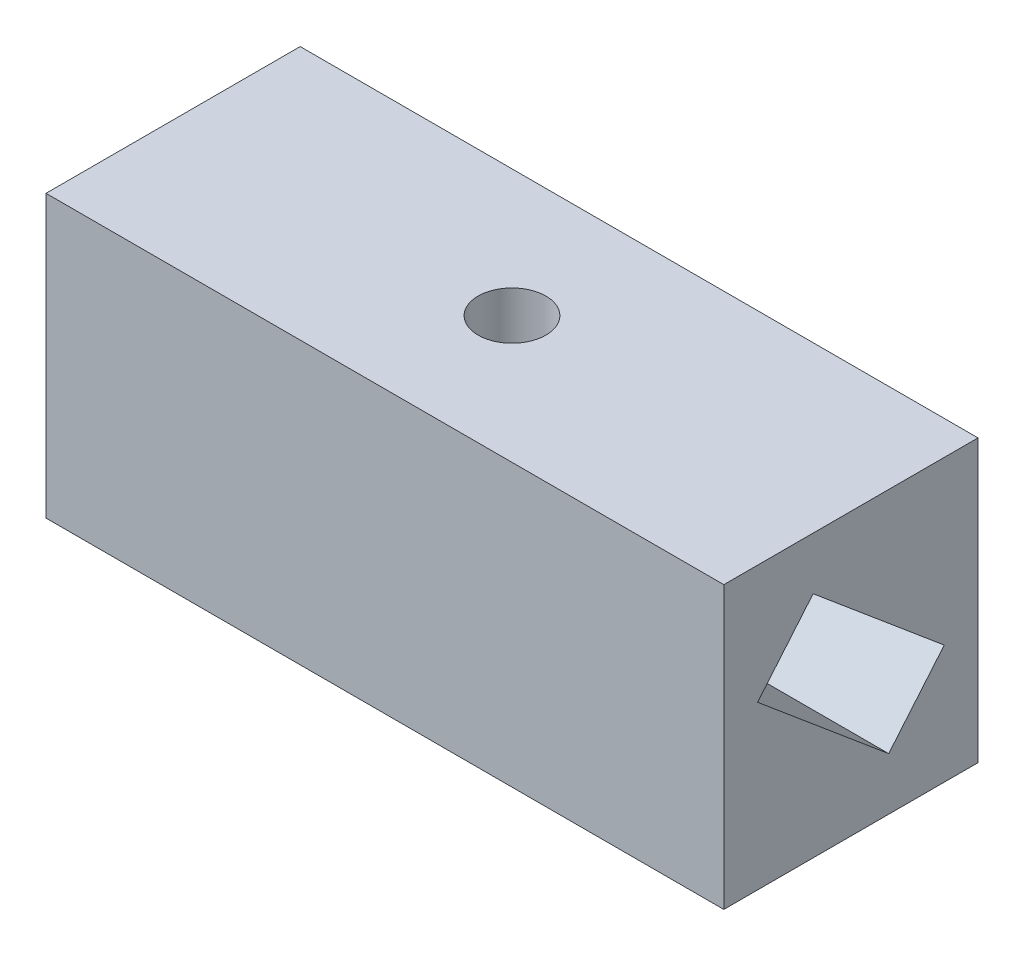
ISO-10303-21;
HEADER;
FILE_DESCRIPTION(('STEP AP214'),'2;1');
FILE_NAME('part.step','',(''),(''),'','','');
FILE_SCHEMA(('AUTOMOTIVE_DESIGN { 1 0 10303 214 1 1 1 1 }'));
ENDSEC;
DATA;
#1=APPLICATION_CONTEXT('core data for automotive mechanical design processes');
#2=APPLICATION_PROTOCOL_DEFINITION('international standard','automotive_design',2000,#1);
#3=PRODUCT_CONTEXT('',#1,'mechanical');
#4=PRODUCT('Part','Part','',(#3));
#5=PRODUCT_RELATED_PRODUCT_CATEGORY('part','',(#4));
#6=PRODUCT_DEFINITION_FORMATION('','',#4);
#7=PRODUCT_DEFINITION_CONTEXT('part definition',#1,'design');
#8=PRODUCT_DEFINITION('design','',#6,#7);
#9=PRODUCT_DEFINITION_SHAPE('','',#8);
#10=(LENGTH_UNIT() NAMED_UNIT(*) SI_UNIT(.MILLI.,.METRE.));
#11=(NAMED_UNIT(*) PLANE_ANGLE_UNIT() SI_UNIT($,.RADIAN.));
#12=(NAMED_UNIT(*) SI_UNIT($,.STERADIAN.) SOLID_ANGLE_UNIT());
#13=UNCERTAINTY_MEASURE_WITH_UNIT(LENGTH_MEASURE(1.E-05),#10,'distance_accuracy_value','');
#14=(GEOMETRIC_REPRESENTATION_CONTEXT(3) GLOBAL_UNCERTAINTY_ASSIGNED_CONTEXT((#13)) GLOBAL_UNIT_ASSIGNED_CONTEXT((#10,
#11,#12)) REPRESENTATION_CONTEXT('',''));
#15=CARTESIAN_POINT('',(0.,0.,0.));
#16=DIRECTION('',(0.,0.,1.));
#17=DIRECTION('',(1.,0.,0.));
#18=AXIS2_PLACEMENT_3D('',#15,#16,#17);
#19=CARTESIAN_POINT('',(40.,33.2,15.));
#20=DIRECTION('',(-1.,0.,0.));
#21=DIRECTION('',(0.,0.,1.));
#22=AXIS2_PLACEMENT_3D('',#19,#20,#21);
#23=PLANE('',#22);
#24=DIRECTION('',(0.,0.766044443118982,-0.642787609686534));
#25=VECTOR('',#24,1.);
#26=CARTESIAN_POINT('',(40.,14.0146718020728,-11.015265684903));
#27=LINE('',#26,#25);
#28=CARTESIAN_POINT('',(40.,6.20101848225919,-4.45883206610039));
#29=VERTEX_POINT('',#28);
#30=CARTESIAN_POINT('',(40.,14.0146718020728,-11.015265684903));
#31=VERTEX_POINT('',#30);
#32=EDGE_CURVE('E151',#29,#31,#27,.T.);
#33=ORIENTED_EDGE('',*,*,#32,.F.);
#34=DIRECTION('',(0.,-0.642787609686535,-0.766044443118982));
#35=VECTOR('',#34,1.);
#36=CARTESIAN_POINT('',(40.,6.20101848225919,-4.45883206610039));
#37=LINE('',#36,#35);
#38=CARTESIAN_POINT('',(40.,19.1853281979272,11.015265684903));
#39=VERTEX_POINT('',#38);
#40=EDGE_CURVE('E48',#39,#29,#37,.T.);
#41=ORIENTED_EDGE('',*,*,#40,.F.);
#42=DIRECTION('',(0.,-0.766044443118982,0.642787609686534));
#43=VECTOR('',#42,1.);
#44=CARTESIAN_POINT('',(40.,26.9989815177408,4.45883206610039));
#45=LINE('',#44,#43);
#46=CARTESIAN_POINT('',(40.,26.9989815177408,4.45883206610039));
#47=VERTEX_POINT('',#46);
#48=EDGE_CURVE('E142',#47,#39,#45,.T.);
#49=ORIENTED_EDGE('',*,*,#48,.F.);
#50=DIRECTION('',(0.,0.642787609686535,0.766044443118982));
#51=VECTOR('',#50,1.);
#52=CARTESIAN_POINT('',(40.,14.0146718020728,-11.015265684903));
#53=LINE('',#52,#51);
#54=EDGE_CURVE('E145',#31,#47,#53,.T.);
#55=ORIENTED_EDGE('',*,*,#54,.F.);
#56=EDGE_LOOP('',(#33,#41,#49,#55));
#57=FACE_BOUND('',#56,.T.);
#58=DIRECTION('',(0.,0.,-1.));
#59=VECTOR('',#58,1.);
#60=CARTESIAN_POINT('',(40.,0.,15.));
#61=LINE('',#60,#59);
#62=CARTESIAN_POINT('',(40.,0.,15.));
#63=VERTEX_POINT('',#62);
#64=CARTESIAN_POINT('',(40.,0.,-15.));
#65=VERTEX_POINT('',#64);
#66=EDGE_CURVE('E194',#63,#65,#61,.T.);
#67=ORIENTED_EDGE('',*,*,#66,.T.);
#68=DIRECTION('',(0.,-1.,0.));
#69=VECTOR('',#68,1.);
#70=CARTESIAN_POINT('',(40.,33.2,-15.));
#71=LINE('',#70,#69);
#72=CARTESIAN_POINT('',(40.,33.2,-15.));
#73=VERTEX_POINT('',#72);
#74=EDGE_CURVE('E11',#73,#65,#71,.T.);
#75=ORIENTED_EDGE('',*,*,#74,.F.);
#76=DIRECTION('',(0.,0.,-1.));
#77=VECTOR('',#76,1.);
#78=CARTESIAN_POINT('',(40.,33.2,15.));
#79=LINE('',#78,#77);
#80=CARTESIAN_POINT('',(40.,33.2,15.));
#81=VERTEX_POINT('',#80);
#82=EDGE_CURVE('E197',#81,#73,#79,.T.);
#83=ORIENTED_EDGE('',*,*,#82,.F.);
#84=DIRECTION('',(0.,-1.,0.));
#85=VECTOR('',#84,1.);
#86=CARTESIAN_POINT('',(40.,33.2,15.));
#87=LINE('',#86,#85);
#88=EDGE_CURVE('E207',#81,#63,#87,.T.);
#89=ORIENTED_EDGE('',*,*,#88,.T.);
#90=EDGE_LOOP('',(#67,#75,#83,#89));
#91=FACE_BOUND('',#90,.T.);
#92=ADVANCED_FACE('F34',(#57,#91),#23,.F.);
#93=CARTESIAN_POINT('',(-40.,33.2,-15.));
#94=DIRECTION('',(0.,0.,1.));
#95=DIRECTION('',(1.,0.,0.));
#96=AXIS2_PLACEMENT_3D('',#93,#94,#95);
#97=PLANE('',#96);
#98=DIRECTION('',(-1.,0.,0.));
#99=VECTOR('',#98,1.);
#100=CARTESIAN_POINT('',(-40.,0.,-15.));
#101=LINE('',#100,#99);
#102=CARTESIAN_POINT('',(-40.,0.,-15.));
#103=VERTEX_POINT('',#102);
#104=EDGE_CURVE('E210',#65,#103,#101,.T.);
#105=ORIENTED_EDGE('',*,*,#104,.T.);
#106=DIRECTION('',(0.,-1.,0.));
#107=VECTOR('',#106,1.);
#108=CARTESIAN_POINT('',(-40.,33.2,-15.));
#109=LINE('',#108,#107);
#110=CARTESIAN_POINT('',(-40.,33.2,-15.));
#111=VERTEX_POINT('',#110);
#112=EDGE_CURVE('E41',#111,#103,#109,.T.);
#113=ORIENTED_EDGE('',*,*,#112,.F.);
#114=DIRECTION('',(-1.,0.,0.));
#115=VECTOR('',#114,1.);
#116=CARTESIAN_POINT('',(-40.,33.2,-15.));
#117=LINE('',#116,#115);
#118=EDGE_CURVE('E200',#73,#111,#117,.T.);
#119=ORIENTED_EDGE('',*,*,#118,.F.);
#120=ORIENTED_EDGE('',*,*,#74,.T.);
#121=EDGE_LOOP('',(#105,#113,#119,#120));
#122=FACE_BOUND('',#121,.T.);
#123=ADVANCED_FACE('F240',(#122),#97,.F.);
#124=CARTESIAN_POINT('',(-40.,33.2,15.));
#125=DIRECTION('',(1.,0.,0.));
#126=DIRECTION('',(0.,0.,-1.));
#127=AXIS2_PLACEMENT_3D('',#124,#125,#126);
#128=PLANE('',#127);
#129=DIRECTION('',(0.,0.766044443118977,-0.642787609686541));
#130=VECTOR('',#129,1.);
#131=CARTESIAN_POINT('',(-40.,26.9989815177408,4.4588320661003));
#132=LINE('',#131,#130);
#133=CARTESIAN_POINT('',(-40.,19.1853281979273,11.015265684903));
#134=VERTEX_POINT('',#133);
#135=CARTESIAN_POINT('',(-40.,26.9989815177408,4.4588320661003));
#136=VERTEX_POINT('',#135);
#137=EDGE_CURVE('E175',#134,#136,#132,.T.);
#138=ORIENTED_EDGE('',*,*,#137,.F.);
#139=DIRECTION('',(0.,0.642787609686541,0.766044443118977));
#140=VECTOR('',#139,1.);
#141=CARTESIAN_POINT('',(-40.,6.20101848225915,-4.45883206610031));
#142=LINE('',#141,#140);
#143=CARTESIAN_POINT('',(-40.,6.20101848225915,-4.45883206610031));
#144=VERTEX_POINT('',#143);
#145=EDGE_CURVE('E56',#144,#134,#142,.T.);
#146=ORIENTED_EDGE('',*,*,#145,.F.);
#147=DIRECTION('',(0.,-0.766044443118977,0.642787609686541));
#148=VECTOR('',#147,1.);
#149=CARTESIAN_POINT('',(-40.,14.0146718020727,-11.015265684903));
#150=LINE('',#149,#148);
#151=CARTESIAN_POINT('',(-40.,14.0146718020727,-11.015265684903));
#152=VERTEX_POINT('',#151);
#153=EDGE_CURVE('E164',#152,#144,#150,.T.);
#154=ORIENTED_EDGE('',*,*,#153,.F.);
#155=DIRECTION('',(0.,-0.642787609686541,-0.766044443118977));
#156=VECTOR('',#155,1.);
#157=CARTESIAN_POINT('',(-40.,14.0146718020727,-11.015265684903));
#158=LINE('',#157,#156);
#159=EDGE_CURVE('E178',#136,#152,#158,.T.);
#160=ORIENTED_EDGE('',*,*,#159,.F.);
#161=EDGE_LOOP('',(#138,#146,#154,#160));
#162=FACE_BOUND('',#161,.T.);
#163=DIRECTION('',(0.,0.,1.));
#164=VECTOR('',#163,1.);
#165=CARTESIAN_POINT('',(-40.,0.,15.));
#166=LINE('',#165,#164);
#167=CARTESIAN_POINT('',(-40.,0.,15.));
#168=VERTEX_POINT('',#167);
#169=EDGE_CURVE('E212',#103,#168,#166,.T.);
#170=ORIENTED_EDGE('',*,*,#169,.T.);
#171=DIRECTION('',(0.,-1.,0.));
#172=VECTOR('',#171,1.);
#173=CARTESIAN_POINT('',(-40.,33.2,15.));
#174=LINE('',#173,#172);
#175=CARTESIAN_POINT('',(-40.,33.2,15.));
#176=VERTEX_POINT('',#175);
#177=EDGE_CURVE('E217',#176,#168,#174,.T.);
#178=ORIENTED_EDGE('',*,*,#177,.F.);
#179=DIRECTION('',(0.,0.,1.));
#180=VECTOR('',#179,1.);
#181=CARTESIAN_POINT('',(-40.,33.2,15.));
#182=LINE('',#181,#180);
#183=EDGE_CURVE('E203',#111,#176,#182,.T.);
#184=ORIENTED_EDGE('',*,*,#183,.F.);
#185=ORIENTED_EDGE('',*,*,#112,.T.);
#186=EDGE_LOOP('',(#170,#178,#184,#185));
#187=FACE_BOUND('',#186,.T.);
#188=ADVANCED_FACE('F224',(#162,#187),#128,.F.);
#189=CARTESIAN_POINT('',(-40.,33.2,15.));
#190=DIRECTION('',(0.,0.,-1.));
#191=DIRECTION('',(-1.,0.,0.));
#192=AXIS2_PLACEMENT_3D('',#189,#190,#191);
#193=PLANE('',#192);
#194=DIRECTION('',(1.,0.,0.));
#195=VECTOR('',#194,1.);
#196=CARTESIAN_POINT('',(-40.,0.,15.));
#197=LINE('',#196,#195);
#198=EDGE_CURVE('E201',#168,#63,#197,.T.);
#199=ORIENTED_EDGE('',*,*,#198,.T.);
#200=ORIENTED_EDGE('',*,*,#88,.F.);
#201=DIRECTION('',(1.,0.,0.));
#202=VECTOR('',#201,1.);
#203=CARTESIAN_POINT('',(-40.,33.2,15.));
#204=LINE('',#203,#202);
#205=EDGE_CURVE('E205',#176,#81,#204,.T.);
#206=ORIENTED_EDGE('',*,*,#205,.F.);
#207=ORIENTED_EDGE('',*,*,#177,.T.);
#208=EDGE_LOOP('',(#199,#200,#206,#207));
#209=FACE_BOUND('',#208,.T.);
#210=ADVANCED_FACE('F233',(#209),#193,.F.);
#211=CARTESIAN_POINT('',(0.,33.2,0.));
#212=DIRECTION('',(0.,-1.,0.));
#213=DIRECTION('',(0.,0.,-1.));
#214=AXIS2_PLACEMENT_3D('',#211,#212,#213);
#215=PLANE('',#214);
#216=CARTESIAN_POINT('',(0.,33.2,0.));
#217=DIRECTION('',(0.,1.,0.));
#218=DIRECTION('',(0.,0.,1.));
#219=AXIS2_PLACEMENT_3D('',#216,#217,#218);
#220=CIRCLE('',#219,4.);
#221=CARTESIAN_POINT('',(0.,33.2,4.));
#222=VERTEX_POINT('',#221);
#223=EDGE_CURVE('E185',#222,#222,#220,.T.);
#224=ORIENTED_EDGE('',*,*,#223,.F.);
#225=EDGE_LOOP('',(#224));
#226=FACE_BOUND('',#225,.T.);
#227=ORIENTED_EDGE('',*,*,#82,.T.);
#228=ORIENTED_EDGE('',*,*,#118,.T.);
#229=ORIENTED_EDGE('',*,*,#183,.T.);
#230=ORIENTED_EDGE('',*,*,#205,.T.);
#231=EDGE_LOOP('',(#227,#228,#229,#230));
#232=FACE_BOUND('',#231,.T.);
#233=ADVANCED_FACE('F239',(#226,#232),#215,.F.);
#234=CARTESIAN_POINT('',(0.,0.,0.));
#235=DIRECTION('',(0.,-1.,0.));
#236=DIRECTION('',(0.,0.,-1.));
#237=AXIS2_PLACEMENT_3D('',#234,#235,#236);
#238=PLANE('',#237);
#239=CARTESIAN_POINT('',(0.,0.,0.));
#240=DIRECTION('',(0.,1.,0.));
#241=DIRECTION('',(0.,0.,1.));
#242=AXIS2_PLACEMENT_3D('',#239,#240,#241);
#243=CIRCLE('',#242,4.);
#244=CARTESIAN_POINT('',(0.,0.,4.));
#245=VERTEX_POINT('',#244);
#246=EDGE_CURVE('E191',#245,#245,#243,.T.);
#247=ORIENTED_EDGE('',*,*,#246,.T.);
#248=EDGE_LOOP('',(#247));
#249=FACE_BOUND('',#248,.T.);
#250=ORIENTED_EDGE('',*,*,#66,.F.);
#251=ORIENTED_EDGE('',*,*,#198,.F.);
#252=ORIENTED_EDGE('',*,*,#169,.F.);
#253=ORIENTED_EDGE('',*,*,#104,.F.);
#254=EDGE_LOOP('',(#250,#251,#252,#253));
#255=FACE_BOUND('',#254,.T.);
#256=ADVANCED_FACE('F230',(#249,#255),#238,.T.);
#257=CARTESIAN_POINT('',(0.,0.,0.));
#258=DIRECTION('',(0.,1.,0.));
#259=DIRECTION('',(0.,0.,1.));
#260=AXIS2_PLACEMENT_3D('',#257,#258,#259);
#261=CYLINDRICAL_SURFACE('',#260,4.);
#262=ORIENTED_EDGE('',*,*,#246,.F.);
#263=EDGE_LOOP('',(#262));
#264=FACE_BOUND('',#263,.T.);
#265=ORIENTED_EDGE('',*,*,#223,.T.);
#266=EDGE_LOOP('',(#265));
#267=FACE_BOUND('',#266,.T.);
#268=ADVANCED_FACE('F254',(#264,#267),#261,.F.);
#269=CARTESIAN_POINT('',(-10.,6.20101848225915,-4.45883206610031));
#270=DIRECTION('',(0.,-0.766044443118977,0.642787609686541));
#271=DIRECTION('',(0.,-0.642787609686541,-0.766044443118977));
#272=AXIS2_PLACEMENT_3D('',#269,#270,#271);
#273=PLANE('',#272);
#274=ORIENTED_EDGE('',*,*,#145,.T.);
#275=DIRECTION('',(-1.,0.,0.));
#276=VECTOR('',#275,1.);
#277=CARTESIAN_POINT('',(-10.,19.1853281979273,11.015265684903));
#278=LINE('',#277,#276);
#279=CARTESIAN_POINT('',(-10.,19.1853281979273,11.015265684903));
#280=VERTEX_POINT('',#279);
#281=EDGE_CURVE('E173',#280,#134,#278,.T.);
#282=ORIENTED_EDGE('',*,*,#281,.F.);
#283=DIRECTION('',(0.,0.642787609686541,0.766044443118977));
#284=VECTOR('',#283,1.);
#285=CARTESIAN_POINT('',(-10.,6.20101848225915,-4.45883206610031));
#286=LINE('',#285,#284);
#287=CARTESIAN_POINT('',(-10.,6.20101848225915,-4.45883206610031));
#288=VERTEX_POINT('',#287);
#289=EDGE_CURVE('E160',#288,#280,#286,.T.);
#290=ORIENTED_EDGE('',*,*,#289,.F.);
#291=DIRECTION('',(-1.,0.,0.));
#292=VECTOR('',#291,1.);
#293=CARTESIAN_POINT('',(-10.,6.20101848225915,-4.45883206610031));
#294=LINE('',#293,#292);
#295=EDGE_CURVE('E183',#288,#144,#294,.T.);
#296=ORIENTED_EDGE('',*,*,#295,.T.);
#297=EDGE_LOOP('',(#274,#282,#290,#296));
#298=FACE_BOUND('',#297,.T.);
#299=ADVANCED_FACE('F261',(#298),#273,.F.);
#300=CARTESIAN_POINT('',(-10.,14.0146718020727,-11.015265684903));
#301=DIRECTION('',(0.,-0.642787609686541,-0.766044443118977));
#302=DIRECTION('',(0.,0.766044443118977,-0.642787609686541));
#303=AXIS2_PLACEMENT_3D('',#300,#301,#302);
#304=PLANE('',#303);
#305=ORIENTED_EDGE('',*,*,#153,.T.);
#306=ORIENTED_EDGE('',*,*,#295,.F.);
#307=DIRECTION('',(0.,-0.766044443118977,0.642787609686541));
#308=VECTOR('',#307,1.);
#309=CARTESIAN_POINT('',(-10.,14.0146718020727,-11.015265684903));
#310=LINE('',#309,#308);
#311=CARTESIAN_POINT('',(-10.,14.0146718020727,-11.015265684903));
#312=VERTEX_POINT('',#311);
#313=EDGE_CURVE('E170',#312,#288,#310,.T.);
#314=ORIENTED_EDGE('',*,*,#313,.F.);
#315=DIRECTION('',(-1.,0.,0.));
#316=VECTOR('',#315,1.);
#317=CARTESIAN_POINT('',(-10.,14.0146718020727,-11.015265684903));
#318=LINE('',#317,#316);
#319=EDGE_CURVE('E186',#312,#152,#318,.T.);
#320=ORIENTED_EDGE('',*,*,#319,.T.);
#321=EDGE_LOOP('',(#305,#306,#314,#320));
#322=FACE_BOUND('',#321,.T.);
#323=ADVANCED_FACE('F265',(#322),#304,.F.);
#324=CARTESIAN_POINT('',(-10.,14.0146718020727,-11.015265684903));
#325=DIRECTION('',(0.,0.766044443118977,-0.642787609686541));
#326=DIRECTION('',(0.,0.642787609686541,0.766044443118977));
#327=AXIS2_PLACEMENT_3D('',#324,#325,#326);
#328=PLANE('',#327);
#329=ORIENTED_EDGE('',*,*,#159,.T.);
#330=ORIENTED_EDGE('',*,*,#319,.F.);
#331=DIRECTION('',(0.,-0.642787609686541,-0.766044443118977));
#332=VECTOR('',#331,1.);
#333=CARTESIAN_POINT('',(-10.,14.0146718020727,-11.015265684903));
#334=LINE('',#333,#332);
#335=CARTESIAN_POINT('',(-10.,26.9989815177408,4.4588320661003));
#336=VERTEX_POINT('',#335);
#337=EDGE_CURVE('E167',#336,#312,#334,.T.);
#338=ORIENTED_EDGE('',*,*,#337,.F.);
#339=DIRECTION('',(-1.,0.,0.));
#340=VECTOR('',#339,1.);
#341=CARTESIAN_POINT('',(-10.,26.9989815177408,4.4588320661003));
#342=LINE('',#341,#340);
#343=EDGE_CURVE('E188',#336,#136,#342,.T.);
#344=ORIENTED_EDGE('',*,*,#343,.T.);
#345=EDGE_LOOP('',(#329,#330,#338,#344));
#346=FACE_BOUND('',#345,.T.);
#347=ADVANCED_FACE('F270',(#346),#328,.F.);
#348=CARTESIAN_POINT('',(-10.,26.9989815177408,4.4588320661003));
#349=DIRECTION('',(0.,0.642787609686541,0.766044443118977));
#350=DIRECTION('',(0.,-0.766044443118977,0.642787609686541));
#351=AXIS2_PLACEMENT_3D('',#348,#349,#350);
#352=PLANE('',#351);
#353=ORIENTED_EDGE('',*,*,#137,.T.);
#354=ORIENTED_EDGE('',*,*,#343,.F.);
#355=DIRECTION('',(0.,0.766044443118977,-0.642787609686541));
#356=VECTOR('',#355,1.);
#357=CARTESIAN_POINT('',(-10.,26.9989815177408,4.4588320661003));
#358=LINE('',#357,#356);
#359=EDGE_CURVE('E163',#280,#336,#358,.T.);
#360=ORIENTED_EDGE('',*,*,#359,.F.);
#361=ORIENTED_EDGE('',*,*,#281,.T.);
#362=EDGE_LOOP('',(#353,#354,#360,#361));
#363=FACE_BOUND('',#362,.T.);
#364=ADVANCED_FACE('F266',(#363),#352,.F.);
#365=CARTESIAN_POINT('',(-10.,0.,0.));
#366=DIRECTION('',(1.,0.,0.));
#367=DIRECTION('',(0.,0.,-1.));
#368=AXIS2_PLACEMENT_3D('',#365,#366,#367);
#369=PLANE('',#368);
#370=ORIENTED_EDGE('',*,*,#289,.T.);
#371=ORIENTED_EDGE('',*,*,#359,.T.);
#372=ORIENTED_EDGE('',*,*,#337,.T.);
#373=ORIENTED_EDGE('',*,*,#313,.T.);
#374=EDGE_LOOP('',(#370,#371,#372,#373));
#375=FACE_BOUND('',#374,.T.);
#376=ADVANCED_FACE('F269',(#375),#369,.F.);
#377=CARTESIAN_POINT('',(10.,6.20101848225919,-4.45883206610039));
#378=DIRECTION('',(0.,-0.766044443118982,0.642787609686535));
#379=DIRECTION('',(0.,-0.642787609686535,-0.766044443118982));
#380=AXIS2_PLACEMENT_3D('',#377,#378,#379);
#381=PLANE('',#380);
#382=ORIENTED_EDGE('',*,*,#40,.T.);
#383=DIRECTION('',(1.,0.,0.));
#384=VECTOR('',#383,1.);
#385=CARTESIAN_POINT('',(10.,6.20101848225919,-4.45883206610039));
#386=LINE('',#385,#384);
#387=CARTESIAN_POINT('',(10.,6.20101848225919,-4.45883206610039));
#388=VERTEX_POINT('',#387);
#389=EDGE_CURVE('E120',#388,#29,#386,.T.);
#390=ORIENTED_EDGE('',*,*,#389,.F.);
#391=DIRECTION('',(0.,-0.642787609686535,-0.766044443118982));
#392=VECTOR('',#391,1.);
#393=CARTESIAN_POINT('',(10.,6.20101848225919,-4.45883206610039));
#394=LINE('',#393,#392);
#395=CARTESIAN_POINT('',(10.,19.1853281979272,11.015265684903));
#396=VERTEX_POINT('',#395);
#397=EDGE_CURVE('E124',#396,#388,#394,.T.);
#398=ORIENTED_EDGE('',*,*,#397,.F.);
#399=DIRECTION('',(1.,0.,0.));
#400=VECTOR('',#399,1.);
#401=CARTESIAN_POINT('',(10.,19.1853281979272,11.015265684903));
#402=LINE('',#401,#400);
#403=EDGE_CURVE('E155',#396,#39,#402,.T.);
#404=ORIENTED_EDGE('',*,*,#403,.T.);
#405=EDGE_LOOP('',(#382,#390,#398,#404));
#406=FACE_BOUND('',#405,.T.);
#407=ADVANCED_FACE('F122',(#406),#381,.F.);
#408=CARTESIAN_POINT('',(10.,26.9989815177408,4.45883206610039));
#409=DIRECTION('',(0.,0.642787609686534,0.766044443118982));
#410=DIRECTION('',(0.,-0.766044443118982,0.642787609686534));
#411=AXIS2_PLACEMENT_3D('',#408,#409,#410);
#412=PLANE('',#411);
#413=ORIENTED_EDGE('',*,*,#48,.T.);
#414=ORIENTED_EDGE('',*,*,#403,.F.);
#415=DIRECTION('',(0.,-0.766044443118982,0.642787609686534));
#416=VECTOR('',#415,1.);
#417=CARTESIAN_POINT('',(10.,26.9989815177408,4.45883206610039));
#418=LINE('',#417,#416);
#419=CARTESIAN_POINT('',(10.,26.9989815177408,4.45883206610039));
#420=VERTEX_POINT('',#419);
#421=EDGE_CURVE('E130',#420,#396,#418,.T.);
#422=ORIENTED_EDGE('',*,*,#421,.F.);
#423=DIRECTION('',(1.,0.,0.));
#424=VECTOR('',#423,1.);
#425=CARTESIAN_POINT('',(10.,26.9989815177408,4.45883206610039));
#426=LINE('',#425,#424);
#427=EDGE_CURVE('E157',#420,#47,#426,.T.);
#428=ORIENTED_EDGE('',*,*,#427,.T.);
#429=EDGE_LOOP('',(#413,#414,#422,#428));
#430=FACE_BOUND('',#429,.T.);
#431=ADVANCED_FACE('F283',(#430),#412,.F.);
#432=CARTESIAN_POINT('',(10.,14.0146718020728,-11.015265684903));
#433=DIRECTION('',(0.,0.766044443118982,-0.642787609686535));
#434=DIRECTION('',(0.,0.642787609686535,0.766044443118982));
#435=AXIS2_PLACEMENT_3D('',#432,#433,#434);
#436=PLANE('',#435);
#437=ORIENTED_EDGE('',*,*,#54,.T.);
#438=ORIENTED_EDGE('',*,*,#427,.F.);
#439=DIRECTION('',(0.,0.642787609686535,0.766044443118982));
#440=VECTOR('',#439,1.);
#441=CARTESIAN_POINT('',(10.,14.0146718020728,-11.015265684903));
#442=LINE('',#441,#440);
#443=CARTESIAN_POINT('',(10.,14.0146718020728,-11.015265684903));
#444=VERTEX_POINT('',#443);
#445=EDGE_CURVE('E138',#444,#420,#442,.T.);
#446=ORIENTED_EDGE('',*,*,#445,.F.);
#447=DIRECTION('',(1.,0.,0.));
#448=VECTOR('',#447,1.);
#449=CARTESIAN_POINT('',(10.,14.0146718020728,-11.015265684903));
#450=LINE('',#449,#448);
#451=EDGE_CURVE('E129',#444,#31,#450,.T.);
#452=ORIENTED_EDGE('',*,*,#451,.T.);
#453=EDGE_LOOP('',(#437,#438,#446,#452));
#454=FACE_BOUND('',#453,.T.);
#455=ADVANCED_FACE('F286',(#454),#436,.F.);
#456=CARTESIAN_POINT('',(10.,14.0146718020728,-11.015265684903));
#457=DIRECTION('',(0.,-0.642787609686534,-0.766044443118982));
#458=DIRECTION('',(0.,0.766044443118982,-0.642787609686534));
#459=AXIS2_PLACEMENT_3D('',#456,#457,#458);
#460=PLANE('',#459);
#461=ORIENTED_EDGE('',*,*,#32,.T.);
#462=ORIENTED_EDGE('',*,*,#451,.F.);
#463=DIRECTION('',(0.,0.766044443118982,-0.642787609686534));
#464=VECTOR('',#463,1.);
#465=CARTESIAN_POINT('',(10.,14.0146718020728,-11.015265684903));
#466=LINE('',#465,#464);
#467=EDGE_CURVE('E133',#388,#444,#466,.T.);
#468=ORIENTED_EDGE('',*,*,#467,.F.);
#469=ORIENTED_EDGE('',*,*,#389,.T.);
#470=EDGE_LOOP('',(#461,#462,#468,#469));
#471=FACE_BOUND('',#470,.T.);
#472=ADVANCED_FACE('F134',(#471),#460,.F.);
#473=CARTESIAN_POINT('',(10.,0.,0.));
#474=DIRECTION('',(1.,0.,0.));
#475=DIRECTION('',(0.,0.,-1.));
#476=AXIS2_PLACEMENT_3D('',#473,#474,#475);
#477=PLANE('',#476);
#478=ORIENTED_EDGE('',*,*,#397,.T.);
#479=ORIENTED_EDGE('',*,*,#467,.T.);
#480=ORIENTED_EDGE('',*,*,#445,.T.);
#481=ORIENTED_EDGE('',*,*,#421,.T.);
#482=EDGE_LOOP('',(#478,#479,#480,#481));
#483=FACE_BOUND('',#482,.T.);
#484=ADVANCED_FACE('F140',(#483),#477,.T.);
#485=CLOSED_SHELL('',(#92,#123,#188,#210,#233,#256,#268,#299,#323,#347,#364,#376,#407,#431,#455,
#472,#484));
#486=MANIFOLD_SOLID_BREP('B2',#485);
#487=ADVANCED_BREP_SHAPE_REPRESENTATION('',(#18,#486),#14);
#488=SHAPE_DEFINITION_REPRESENTATION(#9,#487);
ENDSEC;
END-ISO-10303-21;
